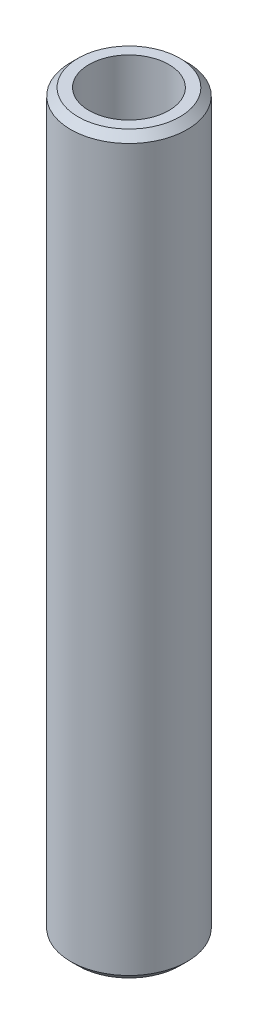
ISO-10303-21;
HEADER;
FILE_DESCRIPTION(('STEP AP214'),'2;1');
FILE_NAME('part.step','',(''),(''),'','','');
FILE_SCHEMA(('AUTOMOTIVE_DESIGN { 1 0 10303 214 1 1 1 1 }'));
ENDSEC;
DATA;
#1=APPLICATION_CONTEXT('core data for automotive mechanical design processes');
#2=APPLICATION_PROTOCOL_DEFINITION('international standard','automotive_design',2000,#1);
#3=PRODUCT_CONTEXT('',#1,'mechanical');
#4=PRODUCT('Part','Part','',(#3));
#5=PRODUCT_RELATED_PRODUCT_CATEGORY('part','',(#4));
#6=PRODUCT_DEFINITION_FORMATION('','',#4);
#7=PRODUCT_DEFINITION_CONTEXT('part definition',#1,'design');
#8=PRODUCT_DEFINITION('design','',#6,#7);
#9=PRODUCT_DEFINITION_SHAPE('','',#8);
#10=(LENGTH_UNIT() NAMED_UNIT(*) SI_UNIT(.MILLI.,.METRE.));
#11=(NAMED_UNIT(*) PLANE_ANGLE_UNIT() SI_UNIT($,.RADIAN.));
#12=(NAMED_UNIT(*) SI_UNIT($,.STERADIAN.) SOLID_ANGLE_UNIT());
#13=UNCERTAINTY_MEASURE_WITH_UNIT(LENGTH_MEASURE(1.E-05),#10,'distance_accuracy_value','');
#14=(GEOMETRIC_REPRESENTATION_CONTEXT(3) GLOBAL_UNCERTAINTY_ASSIGNED_CONTEXT((#13)) GLOBAL_UNIT_ASSIGNED_CONTEXT((#10,
#11,#12)) REPRESENTATION_CONTEXT('',''));
#15=CARTESIAN_POINT('',(0.,0.,0.));
#16=DIRECTION('',(0.,0.,1.));
#17=DIRECTION('',(1.,0.,0.));
#18=AXIS2_PLACEMENT_3D('',#15,#16,#17);
#19=CARTESIAN_POINT('',(0.,600.,0.));
#20=DIRECTION('',(0.,-1.,0.));
#21=DIRECTION('',(0.,0.,-1.));
#22=AXIS2_PLACEMENT_3D('',#19,#20,#21);
#23=CYLINDRICAL_SURFACE('',#22,47.5);
#24=CARTESIAN_POINT('',(0.,594.000582595134,0.));
#25=DIRECTION('',(0.,1.,0.));
#26=DIRECTION('',(0.,0.,1.));
#27=AXIS2_PLACEMENT_3D('',#24,#25,#26);
#28=CIRCLE('',#27,47.5);
#29=CARTESIAN_POINT('',(0.,594.000582595134,47.5));
#30=VERTEX_POINT('',#29);
#31=EDGE_CURVE('E50',#30,#30,#28,.F.);
#32=ORIENTED_EDGE('',*,*,#31,.T.);
#33=EDGE_LOOP('',(#32));
#34=FACE_BOUND('',#33,.T.);
#35=CARTESIAN_POINT('',(0.,5.99941740486598,0.));
#36=DIRECTION('',(0.,1.,0.));
#37=DIRECTION('',(0.,0.,1.));
#38=AXIS2_PLACEMENT_3D('',#35,#36,#37);
#39=CIRCLE('',#38,47.5);
#40=CARTESIAN_POINT('',(0.,5.99941740486598,47.5));
#41=VERTEX_POINT('',#40);
#42=EDGE_CURVE('E51',#41,#41,#39,.T.);
#43=ORIENTED_EDGE('',*,*,#42,.T.);
#44=EDGE_LOOP('',(#43));
#45=FACE_BOUND('',#44,.T.);
#46=ADVANCED_FACE('F39',(#34,#45),#23,.T.);
#47=CARTESIAN_POINT('',(0.,600.,0.));
#48=DIRECTION('',(0.,1.,0.));
#49=DIRECTION('',(0.,0.,1.));
#50=AXIS2_PLACEMENT_3D('',#47,#48,#49);
#51=PLANE('',#50);
#52=CARTESIAN_POINT('',(0.,600.,0.));
#53=DIRECTION('',(0.,1.,0.));
#54=DIRECTION('',(0.,0.,1.));
#55=AXIS2_PLACEMENT_3D('',#52,#53,#54);
#56=CIRCLE('',#55,41.5005825951341);
#57=CARTESIAN_POINT('',(0.,600.,41.5005825951341));
#58=VERTEX_POINT('',#57);
#59=EDGE_CURVE('E54',#58,#58,#56,.T.);
#60=ORIENTED_EDGE('',*,*,#59,.T.);
#61=EDGE_LOOP('',(#60));
#62=FACE_BOUND('',#61,.T.);
#63=CARTESIAN_POINT('',(0.,600.,0.));
#64=DIRECTION('',(0.,1.,0.));
#65=DIRECTION('',(0.,0.,1.));
#66=AXIS2_PLACEMENT_3D('',#63,#64,#65);
#67=CIRCLE('',#66,32.5807188942514);
#68=CARTESIAN_POINT('',(0.,600.,32.5807188942514));
#69=VERTEX_POINT('',#68);
#70=EDGE_CURVE('E58',#69,#69,#67,.T.);
#71=ORIENTED_EDGE('',*,*,#70,.F.);
#72=EDGE_LOOP('',(#71));
#73=FACE_BOUND('',#72,.T.);
#74=ADVANCED_FACE('F69',(#62,#73),#51,.T.);
#75=CARTESIAN_POINT('',(0.,0.,0.));
#76=DIRECTION('',(0.,1.,0.));
#77=DIRECTION('',(0.,0.,1.));
#78=AXIS2_PLACEMENT_3D('',#75,#76,#77);
#79=PLANE('',#78);
#80=CARTESIAN_POINT('',(0.,0.,0.));
#81=DIRECTION('',(0.,1.,0.));
#82=DIRECTION('',(0.,0.,1.));
#83=AXIS2_PLACEMENT_3D('',#80,#81,#82);
#84=CIRCLE('',#83,41.5005825951339);
#85=CARTESIAN_POINT('',(0.,0.,41.5005825951339));
#86=VERTEX_POINT('',#85);
#87=EDGE_CURVE('E10',#86,#86,#84,.F.);
#88=ORIENTED_EDGE('',*,*,#87,.T.);
#89=EDGE_LOOP('',(#88));
#90=FACE_BOUND('',#89,.T.);
#91=CARTESIAN_POINT('',(0.,0.,0.));
#92=DIRECTION('',(0.,1.,0.));
#93=DIRECTION('',(0.,0.,1.));
#94=AXIS2_PLACEMENT_3D('',#91,#92,#93);
#95=CIRCLE('',#94,32.5807188942514);
#96=CARTESIAN_POINT('',(0.,0.,32.5807188942514));
#97=VERTEX_POINT('',#96);
#98=EDGE_CURVE('E63',#97,#97,#95,.T.);
#99=ORIENTED_EDGE('',*,*,#98,.T.);
#100=EDGE_LOOP('',(#99));
#101=FACE_BOUND('',#100,.T.);
#102=ADVANCED_FACE('F75',(#90,#101),#79,.F.);
#103=CARTESIAN_POINT('',(0.,600.,0.));
#104=DIRECTION('',(0.,-1.,0.));
#105=DIRECTION('',(0.,0.,-1.));
#106=AXIS2_PLACEMENT_3D('',#103,#104,#105);
#107=CYLINDRICAL_SURFACE('',#106,32.5807188942514);
#108=ORIENTED_EDGE('',*,*,#70,.T.);
#109=EDGE_LOOP('',(#108));
#110=FACE_BOUND('',#109,.T.);
#111=ORIENTED_EDGE('',*,*,#98,.F.);
#112=EDGE_LOOP('',(#111));
#113=FACE_BOUND('',#112,.T.);
#114=ADVANCED_FACE('F70',(#110,#113),#107,.F.);
#115=CARTESIAN_POINT('',(0.,600.,0.));
#116=DIRECTION('',(0.,-1.,0.));
#117=DIRECTION('',(0.,0.,-1.));
#118=AXIS2_PLACEMENT_3D('',#115,#116,#117);
#119=CONICAL_SURFACE('',#118,41.5005825951341,0.785398163397441);
#120=ORIENTED_EDGE('',*,*,#31,.F.);
#121=EDGE_LOOP('',(#120));
#122=FACE_BOUND('',#121,.T.);
#123=ORIENTED_EDGE('',*,*,#59,.F.);
#124=EDGE_LOOP('',(#123));
#125=FACE_BOUND('',#124,.T.);
#126=ADVANCED_FACE('F81',(#122,#125),#119,.T.);
#127=CARTESIAN_POINT('',(0.,5.99941740486598,0.));
#128=DIRECTION('',(0.,1.,0.));
#129=DIRECTION('',(0.,0.,1.));
#130=AXIS2_PLACEMENT_3D('',#127,#128,#129);
#131=CONICAL_SURFACE('',#130,47.5,0.785398163397455);
#132=ORIENTED_EDGE('',*,*,#87,.F.);
#133=EDGE_LOOP('',(#132));
#134=FACE_BOUND('',#133,.T.);
#135=ORIENTED_EDGE('',*,*,#42,.F.);
#136=EDGE_LOOP('',(#135));
#137=FACE_BOUND('',#136,.T.);
#138=ADVANCED_FACE('F45',(#134,#137),#131,.T.);
#139=CLOSED_SHELL('',(#46,#74,#102,#114,#126,#138));
#140=MANIFOLD_SOLID_BREP('B2',#139);
#141=ADVANCED_BREP_SHAPE_REPRESENTATION('',(#18,#140),#14);
#142=SHAPE_DEFINITION_REPRESENTATION(#9,#141);
ENDSEC;
END-ISO-10303-21;
